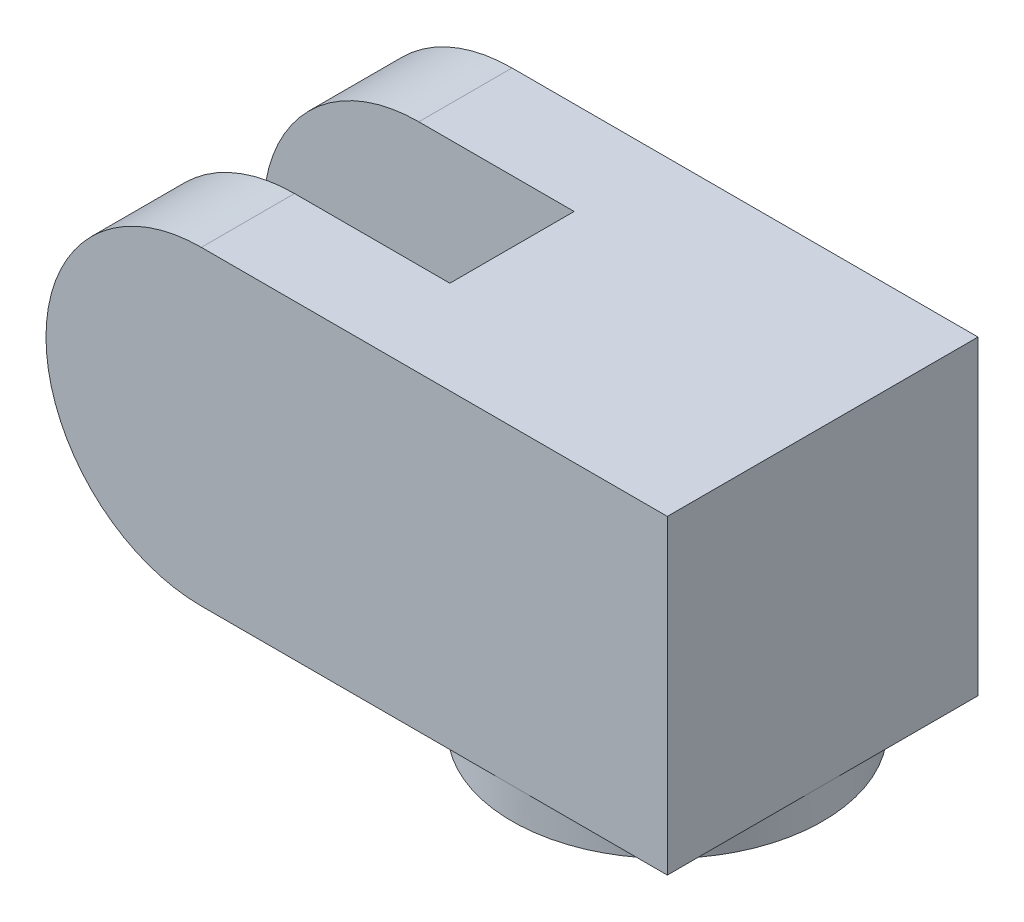
ISO-10303-21;
HEADER;
FILE_DESCRIPTION(('STEP AP214'),'2;1');
FILE_NAME('part.step','',(''),(''),'','','');
FILE_SCHEMA(('AUTOMOTIVE_DESIGN { 1 0 10303 214 1 1 1 1 }'));
ENDSEC;
DATA;
#1=APPLICATION_CONTEXT('core data for automotive mechanical design processes');
#2=APPLICATION_PROTOCOL_DEFINITION('international standard','automotive_design',2000,#1);
#3=PRODUCT_CONTEXT('',#1,'mechanical');
#4=PRODUCT('Part','Part','',(#3));
#5=PRODUCT_RELATED_PRODUCT_CATEGORY('part','',(#4));
#6=PRODUCT_DEFINITION_FORMATION('','',#4);
#7=PRODUCT_DEFINITION_CONTEXT('part definition',#1,'design');
#8=PRODUCT_DEFINITION('design','',#6,#7);
#9=PRODUCT_DEFINITION_SHAPE('','',#8);
#10=(LENGTH_UNIT() NAMED_UNIT(*) SI_UNIT(.MILLI.,.METRE.));
#11=(NAMED_UNIT(*) PLANE_ANGLE_UNIT() SI_UNIT($,.RADIAN.));
#12=(NAMED_UNIT(*) SI_UNIT($,.STERADIAN.) SOLID_ANGLE_UNIT());
#13=UNCERTAINTY_MEASURE_WITH_UNIT(LENGTH_MEASURE(1.E-05),#10,'distance_accuracy_value','');
#14=(GEOMETRIC_REPRESENTATION_CONTEXT(3) GLOBAL_UNCERTAINTY_ASSIGNED_CONTEXT((#13)) GLOBAL_UNIT_ASSIGNED_CONTEXT((#10,
#11,#12)) REPRESENTATION_CONTEXT('',''));
#15=CARTESIAN_POINT('',(0.,0.,0.));
#16=DIRECTION('',(0.,0.,1.));
#17=DIRECTION('',(1.,0.,0.));
#18=AXIS2_PLACEMENT_3D('',#15,#16,#17);
#19=CARTESIAN_POINT('',(0.,0.,0.));
#20=DIRECTION('',(0.,1.,0.));
#21=DIRECTION('',(0.,0.,1.));
#22=AXIS2_PLACEMENT_3D('',#19,#20,#21);
#23=PLANE('',#22);
#24=CARTESIAN_POINT('',(0.,0.,0.));
#25=DIRECTION('',(0.,1.,0.));
#26=DIRECTION('',(0.,0.,1.));
#27=AXIS2_PLACEMENT_3D('',#24,#25,#26);
#28=CIRCLE('',#27,5.);
#29=CARTESIAN_POINT('',(0.,0.,5.));
#30=VERTEX_POINT('',#29);
#31=CARTESIAN_POINT('',(-5.,0.,0.));
#32=VERTEX_POINT('',#31);
#33=EDGE_CURVE('E11',#30,#32,#28,.F.);
#34=ORIENTED_EDGE('',*,*,#33,.F.);
#35=DIRECTION('',(1.,0.,0.));
#36=VECTOR('',#35,1.);
#37=CARTESIAN_POINT('',(-5.,0.,5.));
#38=LINE('',#37,#36);
#39=CARTESIAN_POINT('',(-10.,0.,5.));
#40=VERTEX_POINT('',#39);
#41=EDGE_CURVE('E118',#40,#30,#38,.T.);
#42=ORIENTED_EDGE('',*,*,#41,.F.);
#43=DIRECTION('',(0.,0.,1.));
#44=VECTOR('',#43,1.);
#45=CARTESIAN_POINT('',(-10.,0.,-5.));
#46=LINE('',#45,#44);
#47=CARTESIAN_POINT('',(-10.,0.,2.));
#48=VERTEX_POINT('',#47);
#49=EDGE_CURVE('E186',#48,#40,#46,.T.);
#50=ORIENTED_EDGE('',*,*,#49,.F.);
#51=DIRECTION('',(1.,0.,0.));
#52=VECTOR('',#51,1.);
#53=CARTESIAN_POINT('',(-15.,0.,2.));
#54=LINE('',#53,#52);
#55=CARTESIAN_POINT('',(-5.,0.,2.));
#56=VERTEX_POINT('',#55);
#57=EDGE_CURVE('E173',#48,#56,#54,.T.);
#58=ORIENTED_EDGE('',*,*,#57,.T.);
#59=DIRECTION('',(0.,0.,1.));
#60=VECTOR('',#59,1.);
#61=CARTESIAN_POINT('',(-5.,0.,-5.));
#62=LINE('',#61,#60);
#63=EDGE_CURVE('E136',#32,#56,#62,.T.);
#64=ORIENTED_EDGE('',*,*,#63,.F.);
#65=EDGE_LOOP('',(#34,#42,#50,#58,#64));
#66=FACE_BOUND('',#65,.T.);
#67=ADVANCED_FACE('F38',(#66),#23,.F.);
#68=CARTESIAN_POINT('',(0.,0.,-5.));
#69=VERTEX_POINT('',#68);
#70=EDGE_CURVE('E47',#32,#69,#28,.F.);
#71=ORIENTED_EDGE('',*,*,#70,.F.);
#72=CARTESIAN_POINT('',(-5.,0.,-2.));
#73=VERTEX_POINT('',#72);
#74=EDGE_CURVE('E133',#73,#32,#62,.T.);
#75=ORIENTED_EDGE('',*,*,#74,.F.);
#76=DIRECTION('',(1.,0.,0.));
#77=VECTOR('',#76,1.);
#78=CARTESIAN_POINT('',(-15.,0.,-2.));
#79=LINE('',#78,#77);
#80=CARTESIAN_POINT('',(-10.,0.,-2.));
#81=VERTEX_POINT('',#80);
#82=EDGE_CURVE('E164',#81,#73,#79,.T.);
#83=ORIENTED_EDGE('',*,*,#82,.F.);
#84=CARTESIAN_POINT('',(-10.,0.,-5.));
#85=VERTEX_POINT('',#84);
#86=EDGE_CURVE('E182',#85,#81,#46,.T.);
#87=ORIENTED_EDGE('',*,*,#86,.F.);
#88=DIRECTION('',(-1.,0.,0.));
#89=VECTOR('',#88,1.);
#90=CARTESIAN_POINT('',(-5.,0.,-5.));
#91=LINE('',#90,#89);
#92=EDGE_CURVE('E153',#69,#85,#91,.T.);
#93=ORIENTED_EDGE('',*,*,#92,.F.);
#94=EDGE_LOOP('',(#71,#75,#83,#87,#93));
#95=FACE_BOUND('',#94,.T.);
#96=ADVANCED_FACE('F213',(#95),#23,.F.);
#97=CARTESIAN_POINT('',(0.,0.,0.));
#98=DIRECTION('',(0.,-1.,0.));
#99=DIRECTION('',(0.,0.,-1.));
#100=AXIS2_PLACEMENT_3D('',#97,#98,#99);
#101=CIRCLE('',#100,5.);
#102=CARTESIAN_POINT('',(5.,0.,0.));
#103=VERTEX_POINT('',#102);
#104=EDGE_CURVE('E60',#69,#103,#101,.T.);
#105=ORIENTED_EDGE('',*,*,#104,.F.);
#106=CARTESIAN_POINT('',(5.,0.,-5.));
#107=VERTEX_POINT('',#106);
#108=EDGE_CURVE('E149',#107,#69,#91,.T.);
#109=ORIENTED_EDGE('',*,*,#108,.F.);
#110=DIRECTION('',(0.,0.,-1.));
#111=VECTOR('',#110,1.);
#112=CARTESIAN_POINT('',(5.,0.,-5.));
#113=LINE('',#112,#111);
#114=EDGE_CURVE('E128',#103,#107,#113,.T.);
#115=ORIENTED_EDGE('',*,*,#114,.F.);
#116=EDGE_LOOP('',(#105,#109,#115));
#117=FACE_BOUND('',#116,.T.);
#118=ADVANCED_FACE('F218',(#117),#23,.F.);
#119=CARTESIAN_POINT('',(-5.,10.,-5.));
#120=DIRECTION('',(1.,0.,0.));
#121=DIRECTION('',(0.,0.,-1.));
#122=AXIS2_PLACEMENT_3D('',#119,#120,#121);
#123=PLANE('',#122);
#124=DIRECTION('',(0.,-1.,0.));
#125=VECTOR('',#124,1.);
#126=CARTESIAN_POINT('',(-5.,0.,2.));
#127=LINE('',#126,#125);
#128=CARTESIAN_POINT('',(-5.,10.,2.));
#129=VERTEX_POINT('',#128);
#130=EDGE_CURVE('E175',#129,#56,#127,.T.);
#131=ORIENTED_EDGE('',*,*,#130,.F.);
#132=DIRECTION('',(0.,0.,1.));
#133=VECTOR('',#132,1.);
#134=CARTESIAN_POINT('',(-5.,10.,-5.));
#135=LINE('',#134,#133);
#136=CARTESIAN_POINT('',(-5.,10.,-2.));
#137=VERTEX_POINT('',#136);
#138=EDGE_CURVE('E152',#137,#129,#135,.T.);
#139=ORIENTED_EDGE('',*,*,#138,.F.);
#140=DIRECTION('',(0.,1.,0.));
#141=VECTOR('',#140,1.);
#142=CARTESIAN_POINT('',(-5.,10.,-2.));
#143=LINE('',#142,#141);
#144=EDGE_CURVE('E168',#73,#137,#143,.T.);
#145=ORIENTED_EDGE('',*,*,#144,.F.);
#146=ORIENTED_EDGE('',*,*,#74,.T.);
#147=ORIENTED_EDGE('',*,*,#63,.T.);
#148=EDGE_LOOP('',(#131,#139,#145,#146,#147));
#149=FACE_BOUND('',#148,.T.);
#150=ADVANCED_FACE('F40',(#149),#123,.F.);
#151=CARTESIAN_POINT('',(-5.,10.,5.));
#152=DIRECTION('',(0.,0.,-1.));
#153=DIRECTION('',(-1.,0.,0.));
#154=AXIS2_PLACEMENT_3D('',#151,#152,#153);
#155=PLANE('',#154);
#156=DIRECTION('',(1.,0.,0.));
#157=VECTOR('',#156,1.);
#158=CARTESIAN_POINT('',(-5.,10.,5.));
#159=LINE('',#158,#157);
#160=CARTESIAN_POINT('',(-10.,10.,5.));
#161=VERTEX_POINT('',#160);
#162=CARTESIAN_POINT('',(5.,10.,5.));
#163=VERTEX_POINT('',#162);
#164=EDGE_CURVE('E160',#161,#163,#159,.T.);
#165=ORIENTED_EDGE('',*,*,#164,.F.);
#166=CARTESIAN_POINT('',(-10.,5.,5.));
#167=DIRECTION('',(0.,0.,-1.));
#168=DIRECTION('',(1.,0.,0.));
#169=AXIS2_PLACEMENT_3D('',#166,#167,#168);
#170=CIRCLE('',#169,5.);
#171=EDGE_CURVE('E124',#40,#161,#170,.T.);
#172=ORIENTED_EDGE('',*,*,#171,.F.);
#173=ORIENTED_EDGE('',*,*,#41,.T.);
#174=CARTESIAN_POINT('',(5.,0.,5.));
#175=VERTEX_POINT('',#174);
#176=EDGE_CURVE('E122',#30,#175,#38,.T.);
#177=ORIENTED_EDGE('',*,*,#176,.T.);
#178=DIRECTION('',(0.,-1.,0.));
#179=VECTOR('',#178,1.);
#180=CARTESIAN_POINT('',(5.,10.,5.));
#181=LINE('',#180,#179);
#182=EDGE_CURVE('E141',#163,#175,#181,.T.);
#183=ORIENTED_EDGE('',*,*,#182,.F.);
#184=EDGE_LOOP('',(#165,#172,#173,#177,#183));
#185=FACE_BOUND('',#184,.T.);
#186=ADVANCED_FACE('F120',(#185),#155,.F.);
#187=CARTESIAN_POINT('',(5.,10.,-5.));
#188=DIRECTION('',(-1.,0.,0.));
#189=DIRECTION('',(0.,0.,1.));
#190=AXIS2_PLACEMENT_3D('',#187,#188,#189);
#191=PLANE('',#190);
#192=EDGE_CURVE('E132',#175,#103,#113,.T.);
#193=ORIENTED_EDGE('',*,*,#192,.T.);
#194=ORIENTED_EDGE('',*,*,#114,.T.);
#195=DIRECTION('',(0.,-1.,0.));
#196=VECTOR('',#195,1.);
#197=CARTESIAN_POINT('',(5.,10.,-5.));
#198=LINE('',#197,#196);
#199=CARTESIAN_POINT('',(5.,10.,-5.));
#200=VERTEX_POINT('',#199);
#201=EDGE_CURVE('E142',#200,#107,#198,.T.);
#202=ORIENTED_EDGE('',*,*,#201,.F.);
#203=DIRECTION('',(0.,0.,-1.));
#204=VECTOR('',#203,1.);
#205=CARTESIAN_POINT('',(5.,10.,-5.));
#206=LINE('',#205,#204);
#207=EDGE_CURVE('E158',#163,#200,#206,.T.);
#208=ORIENTED_EDGE('',*,*,#207,.F.);
#209=ORIENTED_EDGE('',*,*,#182,.T.);
#210=EDGE_LOOP('',(#193,#194,#202,#208,#209));
#211=FACE_BOUND('',#210,.T.);
#212=ADVANCED_FACE('F242',(#211),#191,.F.);
#213=CARTESIAN_POINT('',(-5.,10.,-5.));
#214=DIRECTION('',(0.,0.,1.));
#215=DIRECTION('',(1.,0.,0.));
#216=AXIS2_PLACEMENT_3D('',#213,#214,#215);
#217=PLANE('',#216);
#218=ORIENTED_EDGE('',*,*,#108,.T.);
#219=ORIENTED_EDGE('',*,*,#92,.T.);
#220=CARTESIAN_POINT('',(-10.,5.,-5.));
#221=DIRECTION('',(0.,0.,-1.));
#222=DIRECTION('',(1.,0.,0.));
#223=AXIS2_PLACEMENT_3D('',#220,#221,#222);
#224=CIRCLE('',#223,5.);
#225=CARTESIAN_POINT('',(-10.,10.,-5.));
#226=VERTEX_POINT('',#225);
#227=EDGE_CURVE('E191',#85,#226,#224,.T.);
#228=ORIENTED_EDGE('',*,*,#227,.T.);
#229=DIRECTION('',(-1.,0.,0.));
#230=VECTOR('',#229,1.);
#231=CARTESIAN_POINT('',(-5.,10.,-5.));
#232=LINE('',#231,#230);
#233=EDGE_CURVE('E146',#200,#226,#232,.T.);
#234=ORIENTED_EDGE('',*,*,#233,.F.);
#235=ORIENTED_EDGE('',*,*,#201,.T.);
#236=EDGE_LOOP('',(#218,#219,#228,#234,#235));
#237=FACE_BOUND('',#236,.T.);
#238=ADVANCED_FACE('F232',(#237),#217,.F.);
#239=CARTESIAN_POINT('',(0.,10.,0.));
#240=DIRECTION('',(0.,1.,0.));
#241=DIRECTION('',(0.,0.,1.));
#242=AXIS2_PLACEMENT_3D('',#239,#240,#241);
#243=PLANE('',#242);
#244=DIRECTION('',(0.,0.,1.));
#245=VECTOR('',#244,1.);
#246=CARTESIAN_POINT('',(-10.,10.,-5.));
#247=LINE('',#246,#245);
#248=CARTESIAN_POINT('',(-10.,10.,2.));
#249=VERTEX_POINT('',#248);
#250=EDGE_CURVE('E187',#249,#161,#247,.T.);
#251=ORIENTED_EDGE('',*,*,#250,.T.);
#252=ORIENTED_EDGE('',*,*,#164,.T.);
#253=ORIENTED_EDGE('',*,*,#207,.T.);
#254=ORIENTED_EDGE('',*,*,#233,.T.);
#255=CARTESIAN_POINT('',(-10.,10.,-2.));
#256=VERTEX_POINT('',#255);
#257=EDGE_CURVE('E183',#226,#256,#247,.T.);
#258=ORIENTED_EDGE('',*,*,#257,.T.);
#259=DIRECTION('',(1.,0.,0.));
#260=VECTOR('',#259,1.);
#261=CARTESIAN_POINT('',(-15.,10.,-2.));
#262=LINE('',#261,#260);
#263=EDGE_CURVE('E166',#256,#137,#262,.T.);
#264=ORIENTED_EDGE('',*,*,#263,.T.);
#265=ORIENTED_EDGE('',*,*,#138,.T.);
#266=DIRECTION('',(1.,0.,0.));
#267=VECTOR('',#266,1.);
#268=CARTESIAN_POINT('',(-15.,10.,2.));
#269=LINE('',#268,#267);
#270=EDGE_CURVE('E171',#249,#129,#269,.T.);
#271=ORIENTED_EDGE('',*,*,#270,.F.);
#272=EDGE_LOOP('',(#251,#252,#253,#254,#258,#264,#265,#271));
#273=FACE_BOUND('',#272,.T.);
#274=ADVANCED_FACE('F224',(#273),#243,.T.);
#275=EDGE_CURVE('E42',#103,#30,#28,.F.);
#276=ORIENTED_EDGE('',*,*,#275,.F.);
#277=ORIENTED_EDGE('',*,*,#192,.F.);
#278=ORIENTED_EDGE('',*,*,#176,.F.);
#279=EDGE_LOOP('',(#276,#277,#278));
#280=FACE_BOUND('',#279,.T.);
#281=ADVANCED_FACE('F130',(#280),#23,.F.);
#282=CARTESIAN_POINT('',(-15.,10.,-2.));
#283=DIRECTION('',(0.,0.,-1.));
#284=DIRECTION('',(0.,1.,0.));
#285=AXIS2_PLACEMENT_3D('',#282,#283,#284);
#286=PLANE('',#285);
#287=ORIENTED_EDGE('',*,*,#263,.F.);
#288=CARTESIAN_POINT('',(-10.,5.,-2.));
#289=DIRECTION('',(0.,0.,-1.));
#290=DIRECTION('',(0.,1.,0.));
#291=AXIS2_PLACEMENT_3D('',#288,#289,#290);
#292=CIRCLE('',#291,5.);
#293=EDGE_CURVE('E178',#256,#81,#292,.F.);
#294=ORIENTED_EDGE('',*,*,#293,.T.);
#295=ORIENTED_EDGE('',*,*,#82,.T.);
#296=ORIENTED_EDGE('',*,*,#144,.T.);
#297=EDGE_LOOP('',(#287,#294,#295,#296));
#298=FACE_BOUND('',#297,.T.);
#299=ADVANCED_FACE('F223',(#298),#286,.F.);
#300=CARTESIAN_POINT('',(-15.,0.,2.));
#301=DIRECTION('',(0.,0.,1.));
#302=DIRECTION('',(1.,0.,0.));
#303=AXIS2_PLACEMENT_3D('',#300,#301,#302);
#304=PLANE('',#303);
#305=ORIENTED_EDGE('',*,*,#57,.F.);
#306=CARTESIAN_POINT('',(-10.,5.,2.));
#307=DIRECTION('',(0.,0.,1.));
#308=DIRECTION('',(1.,0.,0.));
#309=AXIS2_PLACEMENT_3D('',#306,#307,#308);
#310=CIRCLE('',#309,5.);
#311=EDGE_CURVE('E180',#48,#249,#310,.F.);
#312=ORIENTED_EDGE('',*,*,#311,.T.);
#313=ORIENTED_EDGE('',*,*,#270,.T.);
#314=ORIENTED_EDGE('',*,*,#130,.T.);
#315=EDGE_LOOP('',(#305,#312,#313,#314));
#316=FACE_BOUND('',#315,.T.);
#317=ADVANCED_FACE('F229',(#316),#304,.F.);
#318=CARTESIAN_POINT('',(-10.,5.,-5.));
#319=DIRECTION('',(0.,0.,1.));
#320=DIRECTION('',(1.,0.,0.));
#321=AXIS2_PLACEMENT_3D('',#318,#319,#320);
#322=CYLINDRICAL_SURFACE('',#321,5.);
#323=ORIENTED_EDGE('',*,*,#49,.T.);
#324=ORIENTED_EDGE('',*,*,#171,.T.);
#325=ORIENTED_EDGE('',*,*,#250,.F.);
#326=ORIENTED_EDGE('',*,*,#311,.F.);
#327=EDGE_LOOP('',(#323,#324,#325,#326));
#328=FACE_BOUND('',#327,.T.);
#329=ADVANCED_FACE('F209',(#328),#322,.T.);
#330=ORIENTED_EDGE('',*,*,#257,.F.);
#331=ORIENTED_EDGE('',*,*,#227,.F.);
#332=ORIENTED_EDGE('',*,*,#86,.T.);
#333=ORIENTED_EDGE('',*,*,#293,.F.);
#334=EDGE_LOOP('',(#330,#331,#332,#333));
#335=FACE_BOUND('',#334,.T.);
#336=ADVANCED_FACE('F202',(#335),#322,.T.);
#337=CARTESIAN_POINT('',(0.,-1.,0.));
#338=DIRECTION('',(0.,1.,0.));
#339=DIRECTION('',(0.,0.,1.));
#340=AXIS2_PLACEMENT_3D('',#337,#338,#339);
#341=CYLINDRICAL_SURFACE('',#340,5.);
#342=CARTESIAN_POINT('',(0.,-1.,0.));
#343=DIRECTION('',(0.,-1.,0.));
#344=DIRECTION('',(0.,0.,-1.));
#345=AXIS2_PLACEMENT_3D('',#342,#343,#344);
#346=CIRCLE('',#345,5.);
#347=CARTESIAN_POINT('',(0.,-1.,-5.));
#348=VERTEX_POINT('',#347);
#349=EDGE_CURVE('E192',#348,#348,#346,.T.);
#350=ORIENTED_EDGE('',*,*,#349,.F.);
#351=EDGE_LOOP('',(#350));
#352=FACE_BOUND('',#351,.T.);
#353=ORIENTED_EDGE('',*,*,#104,.T.);
#354=ORIENTED_EDGE('',*,*,#275,.T.);
#355=ORIENTED_EDGE('',*,*,#33,.T.);
#356=ORIENTED_EDGE('',*,*,#70,.T.);
#357=EDGE_LOOP('',(#353,#354,#355,#356));
#358=FACE_BOUND('',#357,.T.);
#359=ADVANCED_FACE('F140',(#352,#358),#341,.T.);
#360=CARTESIAN_POINT('',(0.,-1.,0.));
#361=DIRECTION('',(0.,-1.,0.));
#362=DIRECTION('',(0.,0.,-1.));
#363=AXIS2_PLACEMENT_3D('',#360,#361,#362);
#364=PLANE('',#363);
#365=ORIENTED_EDGE('',*,*,#349,.T.);
#366=EDGE_LOOP('',(#365));
#367=FACE_BOUND('',#366,.T.);
#368=ADVANCED_FACE('F199',(#367),#364,.T.);
#369=CLOSED_SHELL('',(#67,#96,#118,#150,#186,#212,#238,#274,#281,#299,#317,#329,#336,#359,#368));
#370=MANIFOLD_SOLID_BREP('B2',#369);
#371=ADVANCED_BREP_SHAPE_REPRESENTATION('',(#18,#370),#14);
#372=SHAPE_DEFINITION_REPRESENTATION(#9,#371);
ENDSEC;
END-ISO-10303-21;
